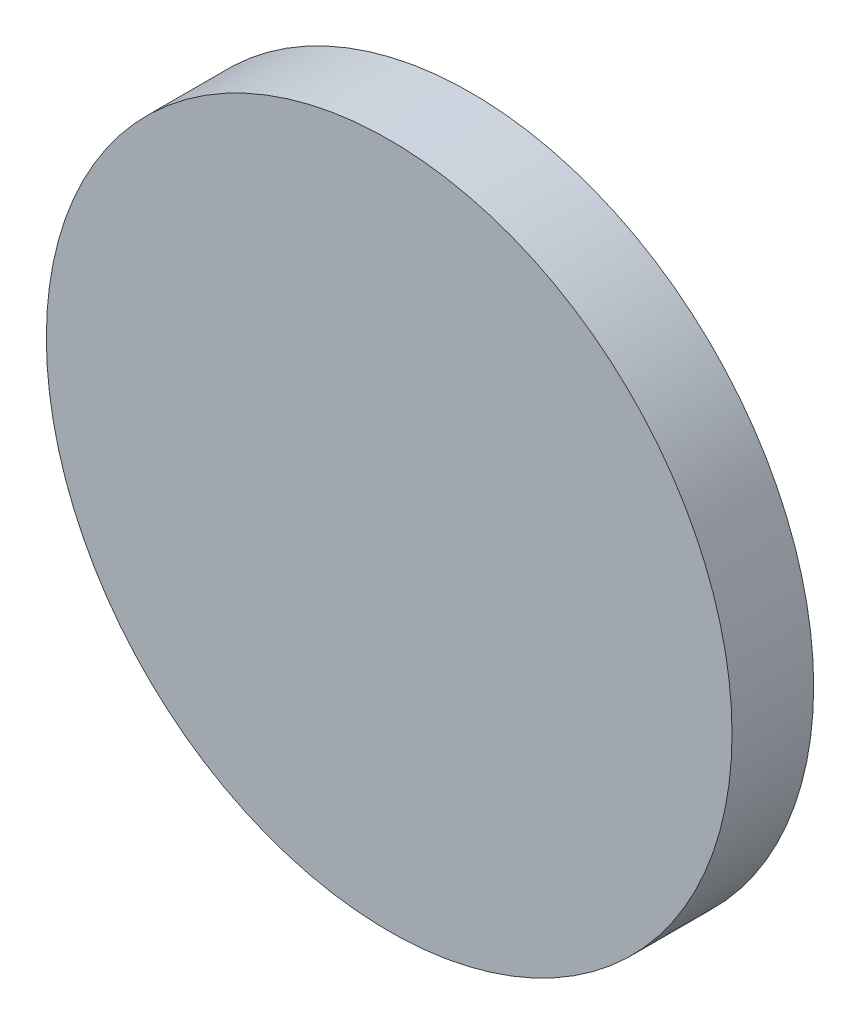
ISO-10303-21;
HEADER;
FILE_DESCRIPTION(('STEP AP214'),'2;1');
FILE_NAME('part.step','',(''),(''),'','','');
FILE_SCHEMA(('AUTOMOTIVE_DESIGN { 1 0 10303 214 1 1 1 1 }'));
ENDSEC;
DATA;
#1=APPLICATION_CONTEXT('core data for automotive mechanical design processes');
#2=APPLICATION_PROTOCOL_DEFINITION('international standard','automotive_design',2000,#1);
#3=PRODUCT_CONTEXT('',#1,'mechanical');
#4=PRODUCT('Part','Part','',(#3));
#5=PRODUCT_RELATED_PRODUCT_CATEGORY('part','',(#4));
#6=PRODUCT_DEFINITION_FORMATION('','',#4);
#7=PRODUCT_DEFINITION_CONTEXT('part definition',#1,'design');
#8=PRODUCT_DEFINITION('design','',#6,#7);
#9=PRODUCT_DEFINITION_SHAPE('','',#8);
#10=(LENGTH_UNIT() NAMED_UNIT(*) SI_UNIT(.MILLI.,.METRE.));
#11=(NAMED_UNIT(*) PLANE_ANGLE_UNIT() SI_UNIT($,.RADIAN.));
#12=(NAMED_UNIT(*) SI_UNIT($,.STERADIAN.) SOLID_ANGLE_UNIT());
#13=UNCERTAINTY_MEASURE_WITH_UNIT(LENGTH_MEASURE(1.E-05),#10,'distance_accuracy_value','');
#14=(GEOMETRIC_REPRESENTATION_CONTEXT(3) GLOBAL_UNCERTAINTY_ASSIGNED_CONTEXT((#13)) GLOBAL_UNIT_ASSIGNED_CONTEXT((#10,
#11,#12)) REPRESENTATION_CONTEXT('',''));
#15=CARTESIAN_POINT('',(0.,0.,0.));
#16=DIRECTION('',(0.,0.,1.));
#17=DIRECTION('',(1.,0.,0.));
#18=AXIS2_PLACEMENT_3D('',#15,#16,#17);
#19=CARTESIAN_POINT('',(0.,0.,0.5));
#20=DIRECTION('',(0.,0.,1.));
#21=DIRECTION('',(1.,0.,0.));
#22=AXIS2_PLACEMENT_3D('',#19,#20,#21);
#23=PLANE('',#22);
#24=CARTESIAN_POINT('',(0.,0.,0.5));
#25=DIRECTION('',(0.,0.,1.));
#26=DIRECTION('',(-1.,0.,0.));
#27=AXIS2_PLACEMENT_3D('',#24,#25,#26);
#28=CIRCLE('',#27,2.1);
#29=CARTESIAN_POINT('',(2.1,0.,0.5));
#30=VERTEX_POINT('',#29);
#31=EDGE_CURVE('E41',#30,#30,#28,.T.);
#32=ORIENTED_EDGE('',*,*,#31,.T.);
#33=EDGE_LOOP('',(#32));
#34=FACE_BOUND('',#33,.T.);
#35=ADVANCED_FACE('F16',(#34),#23,.T.);
#36=CARTESIAN_POINT('',(0.,0.,0.));
#37=DIRECTION('',(0.,0.,1.));
#38=DIRECTION('',(1.,0.,0.));
#39=AXIS2_PLACEMENT_3D('',#36,#37,#38);
#40=PLANE('',#39);
#41=CARTESIAN_POINT('',(0.,0.,0.));
#42=DIRECTION('',(0.,0.,-1.));
#43=DIRECTION('',(-1.,0.,0.));
#44=AXIS2_PLACEMENT_3D('',#41,#42,#43);
#45=CIRCLE('',#44,2.1);
#46=CARTESIAN_POINT('',(2.1,0.,0.));
#47=VERTEX_POINT('',#46);
#48=EDGE_CURVE('E10',#47,#47,#45,.T.);
#49=ORIENTED_EDGE('',*,*,#48,.T.);
#50=EDGE_LOOP('',(#49));
#51=FACE_BOUND('',#50,.T.);
#52=ADVANCED_FACE('F63',(#51),#40,.F.);
#53=CARTESIAN_POINT('',(0.,0.,0.));
#54=DIRECTION('',(0.,0.,1.));
#55=DIRECTION('',(-1.,0.,0.));
#56=AXIS2_PLACEMENT_3D('',#53,#54,#55);
#57=CYLINDRICAL_SURFACE('',#56,2.1);
#58=ORIENTED_EDGE('',*,*,#31,.F.);
#59=DIRECTION('',(0.,0.,-1.));
#60=VECTOR('',#59,1.);
#61=CARTESIAN_POINT('',(2.1,0.,0.));
#62=LINE('',#61,#60);
#63=EDGE_CURVE('E26',#30,#47,#62,.T.);
#64=ORIENTED_EDGE('',*,*,#63,.T.);
#65=ORIENTED_EDGE('',*,*,#48,.F.);
#66=ORIENTED_EDGE('',*,*,#63,.F.);
#67=EDGE_LOOP('',(#58,#64,#65,#66));
#68=FACE_BOUND('',#67,.T.);
#69=ADVANCED_FACE('F18',(#68),#57,.T.);
#70=CLOSED_SHELL('',(#35,#52,#69));
#71=MANIFOLD_SOLID_BREP('B1',#70);
#72=ADVANCED_BREP_SHAPE_REPRESENTATION('',(#18,#71),#14);
#73=SHAPE_DEFINITION_REPRESENTATION(#9,#72);
ENDSEC;
END-ISO-10303-21;
